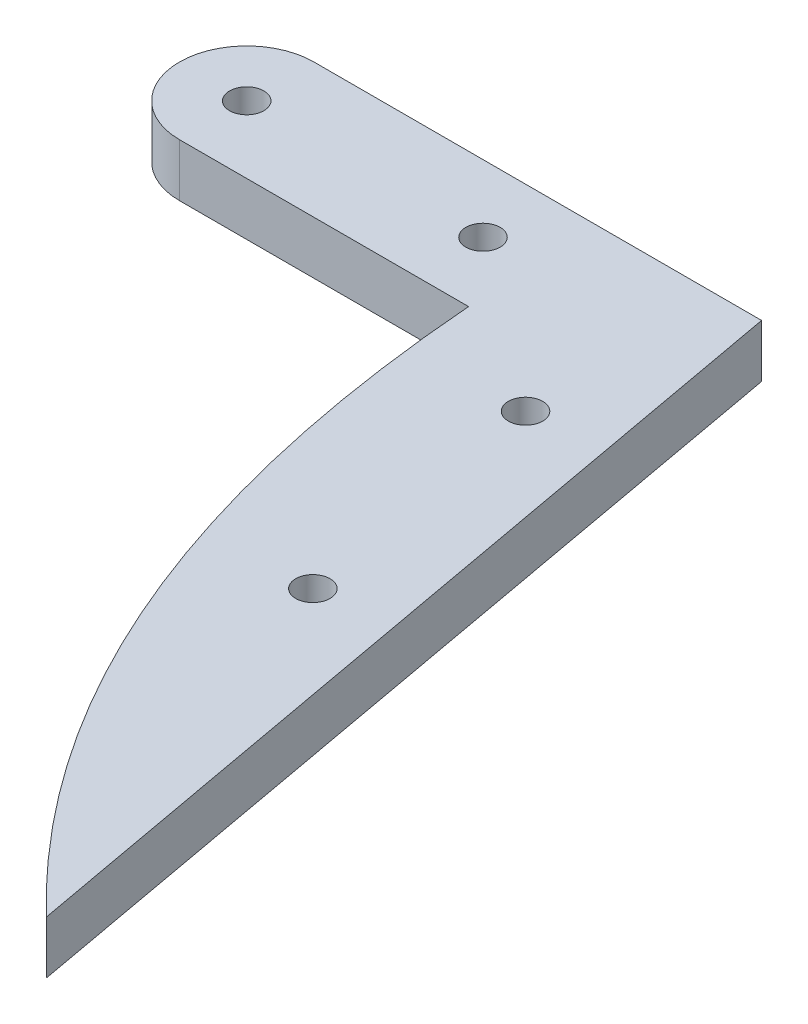
ISO-10303-21;
HEADER;
FILE_DESCRIPTION(('STEP AP214'),'2;1');
FILE_NAME('part.step','',(''),(''),'','','');
FILE_SCHEMA(('AUTOMOTIVE_DESIGN { 1 0 10303 214 1 1 1 1 }'));
ENDSEC;
DATA;
#1=APPLICATION_CONTEXT('core data for automotive mechanical design processes');
#2=APPLICATION_PROTOCOL_DEFINITION('international standard','automotive_design',2000,#1);
#3=PRODUCT_CONTEXT('',#1,'mechanical');
#4=PRODUCT('Part','Part','',(#3));
#5=PRODUCT_RELATED_PRODUCT_CATEGORY('part','',(#4));
#6=PRODUCT_DEFINITION_FORMATION('','',#4);
#7=PRODUCT_DEFINITION_CONTEXT('part definition',#1,'design');
#8=PRODUCT_DEFINITION('design','',#6,#7);
#9=PRODUCT_DEFINITION_SHAPE('','',#8);
#10=(LENGTH_UNIT() NAMED_UNIT(*) SI_UNIT(.MILLI.,.METRE.));
#11=(NAMED_UNIT(*) PLANE_ANGLE_UNIT() SI_UNIT($,.RADIAN.));
#12=(NAMED_UNIT(*) SI_UNIT($,.STERADIAN.) SOLID_ANGLE_UNIT());
#13=UNCERTAINTY_MEASURE_WITH_UNIT(LENGTH_MEASURE(1.E-05),#10,'distance_accuracy_value','');
#14=(GEOMETRIC_REPRESENTATION_CONTEXT(3) GLOBAL_UNCERTAINTY_ASSIGNED_CONTEXT((#13)) GLOBAL_UNIT_ASSIGNED_CONTEXT((#10,
#11,#12)) REPRESENTATION_CONTEXT('',''));
#15=CARTESIAN_POINT('',(0.,0.,0.));
#16=DIRECTION('',(0.,0.,1.));
#17=DIRECTION('',(1.,0.,0.));
#18=AXIS2_PLACEMENT_3D('',#15,#16,#17);
#19=CARTESIAN_POINT('',(0.,5.,-6.36422976501307));
#20=DIRECTION('',(0.,0.,-1.));
#21=DIRECTION('',(-1.,0.,0.));
#22=AXIS2_PLACEMENT_3D('',#19,#20,#21);
#23=PLANE('',#22);
#24=DIRECTION('',(1.,0.,0.));
#25=VECTOR('',#24,1.);
#26=CARTESIAN_POINT('',(0.,0.,-6.36422976501307));
#27=LINE('',#26,#25);
#28=CARTESIAN_POINT('',(-11.18,0.,-6.36422976501306));
#29=VERTEX_POINT('',#28);
#30=CARTESIAN_POINT('',(31.18,0.,-6.36422976501306));
#31=VERTEX_POINT('',#30);
#32=EDGE_CURVE('E94',#29,#31,#27,.T.);
#33=ORIENTED_EDGE('',*,*,#32,.F.);
#34=DIRECTION('',(0.,-1.,0.));
#35=VECTOR('',#34,1.);
#36=CARTESIAN_POINT('',(-11.18,5.,-6.36422976501306));
#37=LINE('',#36,#35);
#38=CARTESIAN_POINT('',(-11.18,5.,-6.36422976501306));
#39=VERTEX_POINT('',#38);
#40=EDGE_CURVE('E11',#39,#29,#37,.T.);
#41=ORIENTED_EDGE('',*,*,#40,.F.);
#42=DIRECTION('',(1.,0.,0.));
#43=VECTOR('',#42,1.);
#44=CARTESIAN_POINT('',(0.,5.,-6.36422976501307));
#45=LINE('',#44,#43);
#46=CARTESIAN_POINT('',(31.18,5.,-6.36422976501306));
#47=VERTEX_POINT('',#46);
#48=EDGE_CURVE('E104',#39,#47,#45,.T.);
#49=ORIENTED_EDGE('',*,*,#48,.T.);
#50=DIRECTION('',(0.,1.,0.));
#51=VECTOR('',#50,1.);
#52=CARTESIAN_POINT('',(31.18,0.,-6.36422976501306));
#53=LINE('',#52,#51);
#54=EDGE_CURVE('E103',#31,#47,#53,.T.);
#55=ORIENTED_EDGE('',*,*,#54,.F.);
#56=EDGE_LOOP('',(#33,#41,#49,#55));
#57=FACE_BOUND('',#56,.T.);
#58=ADVANCED_FACE('F40',(#57),#23,.T.);
#59=CARTESIAN_POINT('',(-11.18,5.,0.));
#60=DIRECTION('',(0.,-1.,0.));
#61=DIRECTION('',(0.,0.,-1.));
#62=AXIS2_PLACEMENT_3D('',#59,#60,#61);
#63=CYLINDRICAL_SURFACE('',#62,6.36422976501307);
#64=CARTESIAN_POINT('',(-11.18,0.,0.));
#65=DIRECTION('',(0.,1.,0.));
#66=DIRECTION('',(0.,0.,1.));
#67=AXIS2_PLACEMENT_3D('',#64,#65,#66);
#68=CIRCLE('',#67,6.36422976501307);
#69=CARTESIAN_POINT('',(-11.18,0.,6.36422976501307));
#70=VERTEX_POINT('',#69);
#71=EDGE_CURVE('E99',#29,#70,#68,.T.);
#72=ORIENTED_EDGE('',*,*,#71,.T.);
#73=DIRECTION('',(0.,-1.,0.));
#74=VECTOR('',#73,1.);
#75=CARTESIAN_POINT('',(-11.18,5.,6.36422976501307));
#76=LINE('',#75,#74);
#77=CARTESIAN_POINT('',(-11.18,5.,6.36422976501307));
#78=VERTEX_POINT('',#77);
#79=EDGE_CURVE('E49',#78,#70,#76,.T.);
#80=ORIENTED_EDGE('',*,*,#79,.F.);
#81=CARTESIAN_POINT('',(-11.18,5.,0.));
#82=DIRECTION('',(0.,1.,0.));
#83=DIRECTION('',(0.,0.,1.));
#84=AXIS2_PLACEMENT_3D('',#81,#82,#83);
#85=CIRCLE('',#84,6.36422976501307);
#86=EDGE_CURVE('E58',#39,#78,#85,.T.);
#87=ORIENTED_EDGE('',*,*,#86,.F.);
#88=ORIENTED_EDGE('',*,*,#40,.T.);
#89=EDGE_LOOP('',(#72,#80,#87,#88));
#90=FACE_BOUND('',#89,.T.);
#91=ADVANCED_FACE('F151',(#90),#63,.T.);
#92=CARTESIAN_POINT('',(-11.18,5.,0.));
#93=DIRECTION('',(0.,-1.,0.));
#94=DIRECTION('',(0.,0.,-1.));
#95=AXIS2_PLACEMENT_3D('',#92,#93,#94);
#96=CYLINDRICAL_SURFACE('',#95,1.625);
#97=CARTESIAN_POINT('',(-11.18,5.,0.));
#98=DIRECTION('',(0.,1.,0.));
#99=DIRECTION('',(0.,0.,1.));
#100=AXIS2_PLACEMENT_3D('',#97,#98,#99);
#101=CIRCLE('',#100,1.625);
#102=CARTESIAN_POINT('',(-11.18,5.,1.625));
#103=VERTEX_POINT('',#102);
#104=EDGE_CURVE('E193',#103,#103,#101,.T.);
#105=ORIENTED_EDGE('',*,*,#104,.T.);
#106=EDGE_LOOP('',(#105));
#107=FACE_BOUND('',#106,.T.);
#108=CARTESIAN_POINT('',(-11.18,0.,0.));
#109=DIRECTION('',(0.,1.,0.));
#110=DIRECTION('',(0.,0.,1.));
#111=AXIS2_PLACEMENT_3D('',#108,#109,#110);
#112=CIRCLE('',#111,1.625);
#113=CARTESIAN_POINT('',(-11.18,0.,1.625));
#114=VERTEX_POINT('',#113);
#115=EDGE_CURVE('E168',#114,#114,#112,.T.);
#116=ORIENTED_EDGE('',*,*,#115,.F.);
#117=EDGE_LOOP('',(#116));
#118=FACE_BOUND('',#117,.T.);
#119=ADVANCED_FACE('F148',(#107,#118),#96,.F.);
#120=CARTESIAN_POINT('',(0.,5.,6.36422976501307));
#121=DIRECTION('',(0.,0.,-1.));
#122=DIRECTION('',(-1.,0.,0.));
#123=AXIS2_PLACEMENT_3D('',#120,#121,#122);
#124=PLANE('',#123);
#125=DIRECTION('',(1.,0.,0.));
#126=VECTOR('',#125,1.);
#127=CARTESIAN_POINT('',(0.,0.,6.36422976501307));
#128=LINE('',#127,#126);
#129=CARTESIAN_POINT('',(16.18,0.,6.36422976501306));
#130=VERTEX_POINT('',#129);
#131=EDGE_CURVE('E161',#70,#130,#128,.T.);
#132=ORIENTED_EDGE('',*,*,#131,.T.);
#133=DIRECTION('',(0.,1.,0.));
#134=VECTOR('',#133,1.);
#135=CARTESIAN_POINT('',(16.18,0.,6.36422976501306));
#136=LINE('',#135,#134);
#137=CARTESIAN_POINT('',(16.18,5.,6.36422976501306));
#138=VERTEX_POINT('',#137);
#139=EDGE_CURVE('E107',#130,#138,#136,.T.);
#140=ORIENTED_EDGE('',*,*,#139,.T.);
#141=DIRECTION('',(1.,0.,0.));
#142=VECTOR('',#141,1.);
#143=CARTESIAN_POINT('',(0.,5.,6.36422976501307));
#144=LINE('',#143,#142);
#145=EDGE_CURVE('E165',#78,#138,#144,.T.);
#146=ORIENTED_EDGE('',*,*,#145,.F.);
#147=ORIENTED_EDGE('',*,*,#79,.T.);
#148=EDGE_LOOP('',(#132,#140,#146,#147));
#149=FACE_BOUND('',#148,.T.);
#150=ADVANCED_FACE('F146',(#149),#124,.F.);
#151=CARTESIAN_POINT('',(11.18,5.,0.));
#152=DIRECTION('',(0.,-1.,0.));
#153=DIRECTION('',(0.,0.,-1.));
#154=AXIS2_PLACEMENT_3D('',#151,#152,#153);
#155=CYLINDRICAL_SURFACE('',#154,1.625);
#156=CARTESIAN_POINT('',(11.18,5.,0.));
#157=DIRECTION('',(0.,1.,0.));
#158=DIRECTION('',(0.,0.,1.));
#159=AXIS2_PLACEMENT_3D('',#156,#157,#158);
#160=CIRCLE('',#159,1.625);
#161=CARTESIAN_POINT('',(11.18,5.,1.625));
#162=VERTEX_POINT('',#161);
#163=EDGE_CURVE('E166',#162,#162,#160,.T.);
#164=ORIENTED_EDGE('',*,*,#163,.T.);
#165=EDGE_LOOP('',(#164));
#166=FACE_BOUND('',#165,.T.);
#167=CARTESIAN_POINT('',(11.18,0.,0.));
#168=DIRECTION('',(0.,1.,0.));
#169=DIRECTION('',(0.,0.,1.));
#170=AXIS2_PLACEMENT_3D('',#167,#168,#169);
#171=CIRCLE('',#170,1.625);
#172=CARTESIAN_POINT('',(11.18,0.,1.625));
#173=VERTEX_POINT('',#172);
#174=EDGE_CURVE('E171',#173,#173,#171,.T.);
#175=ORIENTED_EDGE('',*,*,#174,.F.);
#176=EDGE_LOOP('',(#175));
#177=FACE_BOUND('',#176,.T.);
#178=ADVANCED_FACE('F139',(#166,#177),#155,.F.);
#179=CARTESIAN_POINT('',(0.,5.,0.));
#180=DIRECTION('',(0.,1.,0.));
#181=DIRECTION('',(0.,0.,1.));
#182=AXIS2_PLACEMENT_3D('',#179,#180,#181);
#183=PLANE('',#182);
#184=CARTESIAN_POINT('',(27.4505743004847,5.,12.2462474314971));
#185=DIRECTION('',(0.,1.,0.));
#186=DIRECTION('',(0.,0.,1.));
#187=AXIS2_PLACEMENT_3D('',#184,#185,#186);
#188=CIRCLE('',#187,1.625);
#189=CARTESIAN_POINT('',(27.4505743004847,5.,13.8712474314971));
#190=VERTEX_POINT('',#189);
#191=EDGE_CURVE('E177',#190,#190,#188,.T.);
#192=ORIENTED_EDGE('',*,*,#191,.F.);
#193=EDGE_LOOP('',(#192));
#194=FACE_BOUND('',#193,.T.);
#195=CARTESIAN_POINT('',(31.924922618632,5.,36.842592833363));
#196=DIRECTION('',(0.,1.,0.));
#197=DIRECTION('',(0.,0.,1.));
#198=AXIS2_PLACEMENT_3D('',#195,#196,#197);
#199=CIRCLE('',#198,1.625);
#200=CARTESIAN_POINT('',(31.924922618632,5.,38.467592833363));
#201=VERTEX_POINT('',#200);
#202=EDGE_CURVE('E118',#201,#201,#199,.T.);
#203=ORIENTED_EDGE('',*,*,#202,.F.);
#204=EDGE_LOOP('',(#203));
#205=FACE_BOUND('',#204,.T.);
#206=ORIENTED_EDGE('',*,*,#145,.T.);
#207=CARTESIAN_POINT('',(16.18,5.,6.36422976501306));
#208=CARTESIAN_POINT('',(20.8061303577528,5.,66.6333842131652));
#209=CARTESIAN_POINT('',(68.4708173005463,5.,92.4834974907634));
#210=B_SPLINE_CURVE_WITH_KNOTS('',2,(#207,#208,#209),.UNSPECIFIED.,.F.,.F.,(3,3),(0.,1.),.UNSPECIFIED.);
#211=CARTESIAN_POINT('',(46.2292253102372,5.,76.3642297650131));
#212=VERTEX_POINT('',#211);
#213=EDGE_CURVE('E111',#138,#212,#210,.T.);
#214=ORIENTED_EDGE('',*,*,#213,.T.);
#215=DIRECTION('',(0.178973932725895,0.,0.983853816074638));
#216=VECTOR('',#215,1.);
#217=CARTESIAN_POINT('',(31.3018927952785,5.,-5.69416183969994));
#218=LINE('',#217,#216);
#219=EDGE_CURVE('E115',#47,#212,#218,.T.);
#220=ORIENTED_EDGE('',*,*,#219,.F.);
#221=ORIENTED_EDGE('',*,*,#48,.F.);
#222=ORIENTED_EDGE('',*,*,#86,.T.);
#223=EDGE_LOOP('',(#206,#214,#220,#221,#222));
#224=FACE_BOUND('',#223,.T.);
#225=ORIENTED_EDGE('',*,*,#104,.F.);
#226=EDGE_LOOP('',(#225));
#227=FACE_BOUND('',#226,.T.);
#228=ORIENTED_EDGE('',*,*,#163,.F.);
#229=EDGE_LOOP('',(#228));
#230=FACE_BOUND('',#229,.T.);
#231=ADVANCED_FACE('F136',(#194,#205,#224,#227,#230),#183,.T.);
#232=CARTESIAN_POINT('',(0.,0.,0.));
#233=DIRECTION('',(0.,1.,0.));
#234=DIRECTION('',(0.,0.,1.));
#235=AXIS2_PLACEMENT_3D('',#232,#233,#234);
#236=PLANE('',#235);
#237=CARTESIAN_POINT('',(27.4505743004847,0.,12.2462474314971));
#238=DIRECTION('',(0.,1.,0.));
#239=DIRECTION('',(0.,0.,1.));
#240=AXIS2_PLACEMENT_3D('',#237,#238,#239);
#241=CIRCLE('',#240,1.625);
#242=CARTESIAN_POINT('',(27.4505743004847,0.,13.8712474314971));
#243=VERTEX_POINT('',#242);
#244=EDGE_CURVE('E43',#243,#243,#241,.T.);
#245=ORIENTED_EDGE('',*,*,#244,.T.);
#246=EDGE_LOOP('',(#245));
#247=FACE_BOUND('',#246,.T.);
#248=CARTESIAN_POINT('',(31.924922618632,0.,36.842592833363));
#249=DIRECTION('',(0.,1.,0.));
#250=DIRECTION('',(0.,0.,1.));
#251=AXIS2_PLACEMENT_3D('',#248,#249,#250);
#252=CIRCLE('',#251,1.625);
#253=CARTESIAN_POINT('',(31.924922618632,0.,38.467592833363));
#254=VERTEX_POINT('',#253);
#255=EDGE_CURVE('E175',#254,#254,#252,.T.);
#256=ORIENTED_EDGE('',*,*,#255,.T.);
#257=EDGE_LOOP('',(#256));
#258=FACE_BOUND('',#257,.T.);
#259=ORIENTED_EDGE('',*,*,#32,.T.);
#260=DIRECTION('',(0.178973932725895,0.,0.983853816074638));
#261=VECTOR('',#260,1.);
#262=CARTESIAN_POINT('',(31.3018927952785,0.,-5.69416183969994));
#263=LINE('',#262,#261);
#264=CARTESIAN_POINT('',(46.2292253102372,0.,76.3642297650131));
#265=VERTEX_POINT('',#264);
#266=EDGE_CURVE('E75',#31,#265,#263,.T.);
#267=ORIENTED_EDGE('',*,*,#266,.T.);
#268=CARTESIAN_POINT('',(16.18,0.,6.36422976501306));
#269=CARTESIAN_POINT('',(20.8061303577528,0.,66.6333842131652));
#270=CARTESIAN_POINT('',(68.4708173005463,0.,92.4834974907634));
#271=B_SPLINE_CURVE_WITH_KNOTS('',2,(#268,#269,#270),.UNSPECIFIED.,.F.,.F.,(3,3),(0.,1.),.UNSPECIFIED.);
#272=EDGE_CURVE('E108',#130,#265,#271,.T.);
#273=ORIENTED_EDGE('',*,*,#272,.F.);
#274=ORIENTED_EDGE('',*,*,#131,.F.);
#275=ORIENTED_EDGE('',*,*,#71,.F.);
#276=EDGE_LOOP('',(#259,#267,#273,#274,#275));
#277=FACE_BOUND('',#276,.T.);
#278=ORIENTED_EDGE('',*,*,#115,.T.);
#279=EDGE_LOOP('',(#278));
#280=FACE_BOUND('',#279,.T.);
#281=ORIENTED_EDGE('',*,*,#174,.T.);
#282=EDGE_LOOP('',(#281));
#283=FACE_BOUND('',#282,.T.);
#284=ADVANCED_FACE('F96',(#247,#258,#277,#280,#283),#236,.F.);
#285=CARTESIAN_POINT('',(31.3018927952785,0.,-5.69416183969994));
#286=DIRECTION('',(-0.983853816074638,0.,0.178973932725895));
#287=DIRECTION('',(0.178973932725895,0.,0.983853816074638));
#288=AXIS2_PLACEMENT_3D('',#285,#286,#287);
#289=PLANE('',#288);
#290=ORIENTED_EDGE('',*,*,#219,.T.);
#291=DIRECTION('',(0.,1.,0.));
#292=VECTOR('',#291,1.);
#293=CARTESIAN_POINT('',(46.2292253102372,0.,76.3642297650131));
#294=LINE('',#293,#292);
#295=EDGE_CURVE('E91',#265,#212,#294,.T.);
#296=ORIENTED_EDGE('',*,*,#295,.F.);
#297=ORIENTED_EDGE('',*,*,#266,.F.);
#298=ORIENTED_EDGE('',*,*,#54,.T.);
#299=EDGE_LOOP('',(#290,#296,#297,#298));
#300=FACE_BOUND('',#299,.T.);
#301=ADVANCED_FACE('F110',(#300),#289,.F.);
#302=DIRECTION('',(0.,1.,0.));
#303=VECTOR('',#302,1.);
#304=SURFACE_OF_LINEAR_EXTRUSION('',#271,#303);
#305=ORIENTED_EDGE('',*,*,#213,.F.);
#306=ORIENTED_EDGE('',*,*,#139,.F.);
#307=ORIENTED_EDGE('',*,*,#272,.T.);
#308=ORIENTED_EDGE('',*,*,#295,.T.);
#309=EDGE_LOOP('',(#305,#306,#307,#308));
#310=FACE_BOUND('',#309,.T.);
#311=ADVANCED_FACE('F128',(#310),#304,.T.);
#312=CARTESIAN_POINT('',(31.924922618632,-25.,36.842592833363));
#313=DIRECTION('',(0.,1.,0.));
#314=DIRECTION('',(0.,0.,1.));
#315=AXIS2_PLACEMENT_3D('',#312,#313,#314);
#316=CYLINDRICAL_SURFACE('',#315,1.625);
#317=ORIENTED_EDGE('',*,*,#202,.T.);
#318=EDGE_LOOP('',(#317));
#319=FACE_BOUND('',#318,.T.);
#320=ORIENTED_EDGE('',*,*,#255,.F.);
#321=EDGE_LOOP('',(#320));
#322=FACE_BOUND('',#321,.T.);
#323=ADVANCED_FACE('F132',(#319,#322),#316,.F.);
#324=CARTESIAN_POINT('',(27.4505743004847,-25.,12.2462474314971));
#325=DIRECTION('',(0.,1.,0.));
#326=DIRECTION('',(0.,0.,1.));
#327=AXIS2_PLACEMENT_3D('',#324,#325,#326);
#328=CYLINDRICAL_SURFACE('',#327,1.625);
#329=ORIENTED_EDGE('',*,*,#191,.T.);
#330=EDGE_LOOP('',(#329));
#331=FACE_BOUND('',#330,.T.);
#332=ORIENTED_EDGE('',*,*,#244,.F.);
#333=EDGE_LOOP('',(#332));
#334=FACE_BOUND('',#333,.T.);
#335=ADVANCED_FACE('F214',(#331,#334),#328,.F.);
#336=CLOSED_SHELL('',(#58,#91,#119,#150,#178,#231,#284,#301,#311,#323,#335));
#337=MANIFOLD_SOLID_BREP('B2',#336);
#338=ADVANCED_BREP_SHAPE_REPRESENTATION('',(#18,#337),#14);
#339=SHAPE_DEFINITION_REPRESENTATION(#9,#338);
ENDSEC;
END-ISO-10303-21;
